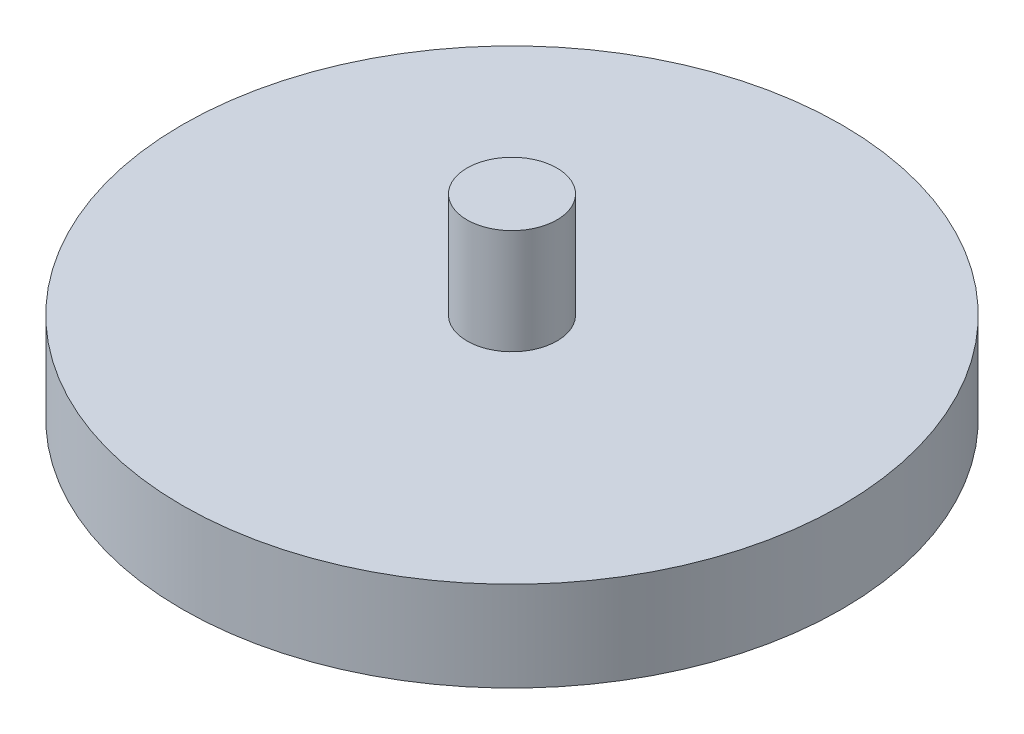
ISO-10303-21;
HEADER;
FILE_DESCRIPTION(('STEP AP214'),'2;1');
FILE_NAME('part.step','',(''),(''),'','','');
FILE_SCHEMA(('AUTOMOTIVE_DESIGN { 1 0 10303 214 1 1 1 1 }'));
ENDSEC;
DATA;
#1=APPLICATION_CONTEXT('core data for automotive mechanical design processes');
#2=APPLICATION_PROTOCOL_DEFINITION('international standard','automotive_design',2000,#1);
#3=PRODUCT_CONTEXT('',#1,'mechanical');
#4=PRODUCT('Part','Part','',(#3));
#5=PRODUCT_RELATED_PRODUCT_CATEGORY('part','',(#4));
#6=PRODUCT_DEFINITION_FORMATION('','',#4);
#7=PRODUCT_DEFINITION_CONTEXT('part definition',#1,'design');
#8=PRODUCT_DEFINITION('design','',#6,#7);
#9=PRODUCT_DEFINITION_SHAPE('','',#8);
#10=(LENGTH_UNIT() NAMED_UNIT(*) SI_UNIT(.MILLI.,.METRE.));
#11=(NAMED_UNIT(*) PLANE_ANGLE_UNIT() SI_UNIT($,.RADIAN.));
#12=(NAMED_UNIT(*) SI_UNIT($,.STERADIAN.) SOLID_ANGLE_UNIT());
#13=UNCERTAINTY_MEASURE_WITH_UNIT(LENGTH_MEASURE(1.E-05),#10,'distance_accuracy_value','');
#14=(GEOMETRIC_REPRESENTATION_CONTEXT(3) GLOBAL_UNCERTAINTY_ASSIGNED_CONTEXT((#13)) GLOBAL_UNIT_ASSIGNED_CONTEXT((#10,
#11,#12)) REPRESENTATION_CONTEXT('',''));
#15=CARTESIAN_POINT('',(0.,0.,0.));
#16=DIRECTION('',(0.,0.,1.));
#17=DIRECTION('',(1.,0.,0.));
#18=AXIS2_PLACEMENT_3D('',#15,#16,#17);
#19=CARTESIAN_POINT('',(0.,60.,0.));
#20=DIRECTION('',(0.,-1.,0.));
#21=DIRECTION('',(0.,0.,-1.));
#22=AXIS2_PLACEMENT_3D('',#19,#20,#21);
#23=CYLINDRICAL_SURFACE('',#22,220.);
#24=CARTESIAN_POINT('',(0.,60.,0.));
#25=DIRECTION('',(0.,1.,0.));
#26=DIRECTION('',(0.,0.,1.));
#27=AXIS2_PLACEMENT_3D('',#24,#25,#26);
#28=CIRCLE('',#27,220.);
#29=CARTESIAN_POINT('',(0.,60.,220.));
#30=VERTEX_POINT('',#29);
#31=EDGE_CURVE('E43',#30,#30,#28,.T.);
#32=ORIENTED_EDGE('',*,*,#31,.F.);
#33=EDGE_LOOP('',(#32));
#34=FACE_BOUND('',#33,.T.);
#35=CARTESIAN_POINT('',(0.,0.,0.));
#36=DIRECTION('',(0.,1.,0.));
#37=DIRECTION('',(0.,0.,1.));
#38=AXIS2_PLACEMENT_3D('',#35,#36,#37);
#39=CIRCLE('',#38,220.);
#40=CARTESIAN_POINT('',(0.,0.,220.));
#41=VERTEX_POINT('',#40);
#42=EDGE_CURVE('E49',#41,#41,#39,.T.);
#43=ORIENTED_EDGE('',*,*,#42,.T.);
#44=EDGE_LOOP('',(#43));
#45=FACE_BOUND('',#44,.T.);
#46=ADVANCED_FACE('F36',(#34,#45),#23,.T.);
#47=CARTESIAN_POINT('',(0.,60.,0.));
#48=DIRECTION('',(0.,1.,0.));
#49=DIRECTION('',(0.,0.,1.));
#50=AXIS2_PLACEMENT_3D('',#47,#48,#49);
#51=PLANE('',#50);
#52=CARTESIAN_POINT('',(0.,60.,0.));
#53=DIRECTION('',(0.,1.,0.));
#54=DIRECTION('',(0.,0.,1.));
#55=AXIS2_PLACEMENT_3D('',#52,#53,#54);
#56=CIRCLE('',#55,30.);
#57=CARTESIAN_POINT('',(0.,60.,30.));
#58=VERTEX_POINT('',#57);
#59=EDGE_CURVE('E58',#58,#58,#56,.T.);
#60=ORIENTED_EDGE('',*,*,#59,.F.);
#61=EDGE_LOOP('',(#60));
#62=FACE_BOUND('',#61,.T.);
#63=ORIENTED_EDGE('',*,*,#31,.T.);
#64=EDGE_LOOP('',(#63));
#65=FACE_BOUND('',#64,.T.);
#66=ADVANCED_FACE('F86',(#62,#65),#51,.T.);
#67=CARTESIAN_POINT('',(0.,0.,0.));
#68=DIRECTION('',(0.,1.,0.));
#69=DIRECTION('',(0.,0.,1.));
#70=AXIS2_PLACEMENT_3D('',#67,#68,#69);
#71=PLANE('',#70);
#72=CARTESIAN_POINT('',(0.,0.,0.));
#73=DIRECTION('',(0.,1.,0.));
#74=DIRECTION('',(0.,0.,1.));
#75=AXIS2_PLACEMENT_3D('',#72,#73,#74);
#76=CIRCLE('',#75,30.);
#77=CARTESIAN_POINT('',(0.,0.,30.));
#78=VERTEX_POINT('',#77);
#79=EDGE_CURVE('E10',#78,#78,#76,.F.);
#80=ORIENTED_EDGE('',*,*,#79,.F.);
#81=EDGE_LOOP('',(#80));
#82=FACE_BOUND('',#81,.T.);
#83=ORIENTED_EDGE('',*,*,#42,.F.);
#84=EDGE_LOOP('',(#83));
#85=FACE_BOUND('',#84,.T.);
#86=ADVANCED_FACE('F91',(#82,#85),#71,.F.);
#87=CARTESIAN_POINT('',(0.,130.,0.));
#88=DIRECTION('',(0.,-1.,0.));
#89=DIRECTION('',(0.,0.,-1.));
#90=AXIS2_PLACEMENT_3D('',#87,#88,#89);
#91=CYLINDRICAL_SURFACE('',#90,30.);
#92=CARTESIAN_POINT('',(0.,130.,0.));
#93=DIRECTION('',(0.,1.,0.));
#94=DIRECTION('',(0.,0.,1.));
#95=AXIS2_PLACEMENT_3D('',#92,#93,#94);
#96=CIRCLE('',#95,30.);
#97=CARTESIAN_POINT('',(0.,130.,30.));
#98=VERTEX_POINT('',#97);
#99=EDGE_CURVE('E56',#98,#98,#96,.T.);
#100=ORIENTED_EDGE('',*,*,#99,.F.);
#101=EDGE_LOOP('',(#100));
#102=FACE_BOUND('',#101,.T.);
#103=ORIENTED_EDGE('',*,*,#59,.T.);
#104=EDGE_LOOP('',(#103));
#105=FACE_BOUND('',#104,.T.);
#106=ADVANCED_FACE('F82',(#102,#105),#91,.T.);
#107=CARTESIAN_POINT('',(0.,130.,0.));
#108=DIRECTION('',(0.,1.,0.));
#109=DIRECTION('',(0.,0.,1.));
#110=AXIS2_PLACEMENT_3D('',#107,#108,#109);
#111=PLANE('',#110);
#112=ORIENTED_EDGE('',*,*,#99,.T.);
#113=EDGE_LOOP('',(#112));
#114=FACE_BOUND('',#113,.T.);
#115=ADVANCED_FACE('F75',(#114),#111,.T.);
#116=CARTESIAN_POINT('',(0.,-70.,0.));
#117=DIRECTION('',(0.,1.,0.));
#118=DIRECTION('',(0.,0.,1.));
#119=AXIS2_PLACEMENT_3D('',#116,#117,#118);
#120=CYLINDRICAL_SURFACE('',#119,30.);
#121=CARTESIAN_POINT('',(0.,-70.,0.));
#122=DIRECTION('',(0.,-1.,0.));
#123=DIRECTION('',(0.,0.,-1.));
#124=AXIS2_PLACEMENT_3D('',#121,#122,#123);
#125=CIRCLE('',#124,30.);
#126=CARTESIAN_POINT('',(0.,-70.,-30.));
#127=VERTEX_POINT('',#126);
#128=EDGE_CURVE('E62',#127,#127,#125,.T.);
#129=ORIENTED_EDGE('',*,*,#128,.F.);
#130=EDGE_LOOP('',(#129));
#131=FACE_BOUND('',#130,.T.);
#132=ORIENTED_EDGE('',*,*,#79,.T.);
#133=EDGE_LOOP('',(#132));
#134=FACE_BOUND('',#133,.T.);
#135=ADVANCED_FACE('F73',(#131,#134),#120,.T.);
#136=CARTESIAN_POINT('',(0.,-70.,0.));
#137=DIRECTION('',(0.,-1.,0.));
#138=DIRECTION('',(0.,0.,-1.));
#139=AXIS2_PLACEMENT_3D('',#136,#137,#138);
#140=PLANE('',#139);
#141=ORIENTED_EDGE('',*,*,#128,.T.);
#142=EDGE_LOOP('',(#141));
#143=FACE_BOUND('',#142,.T.);
#144=ADVANCED_FACE('F71',(#143),#140,.T.);
#145=CLOSED_SHELL('',(#46,#66,#86,#106,#115,#135,#144));
#146=MANIFOLD_SOLID_BREP('B2',#145);
#147=ADVANCED_BREP_SHAPE_REPRESENTATION('',(#18,#146),#14);
#148=SHAPE_DEFINITION_REPRESENTATION(#9,#147);
ENDSEC;
END-ISO-10303-21;
